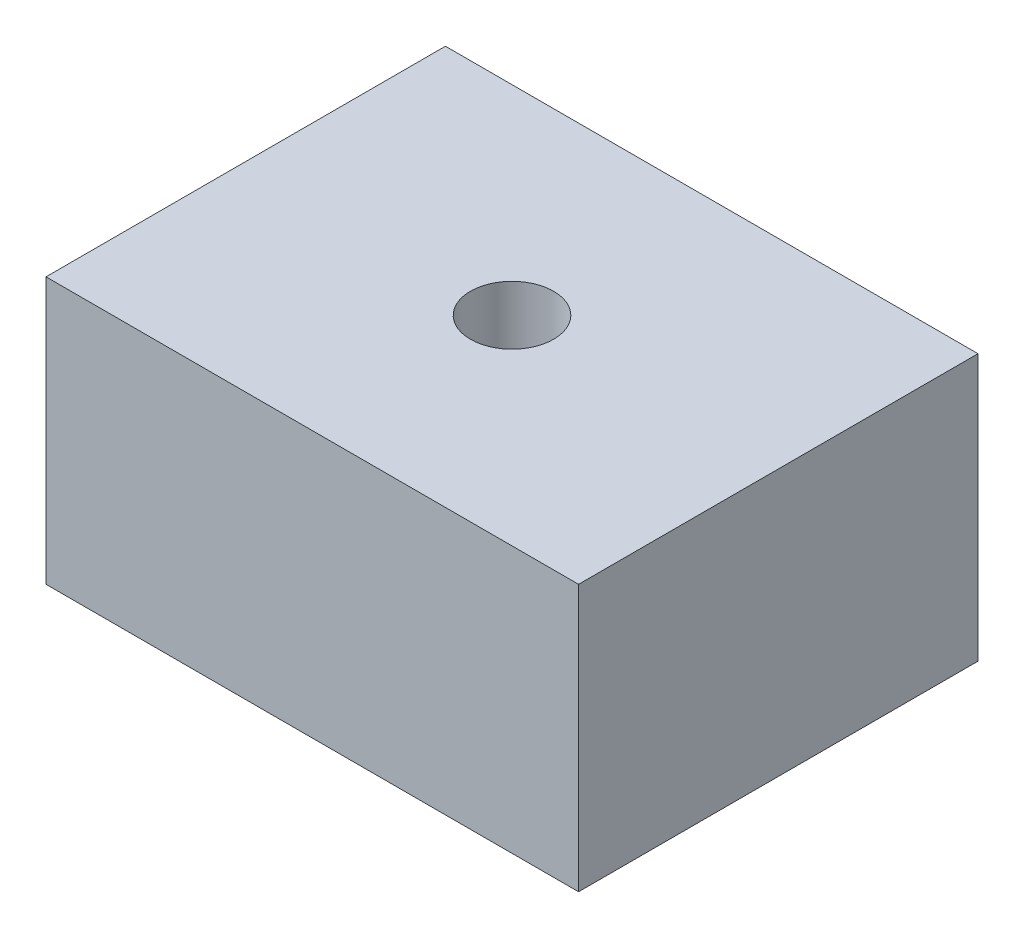
ISO-10303-21;
HEADER;
FILE_DESCRIPTION(('STEP AP214'),'2;1');
FILE_NAME('part.step','',(''),(''),'','','');
FILE_SCHEMA(('AUTOMOTIVE_DESIGN { 1 0 10303 214 1 1 1 1 }'));
ENDSEC;
DATA;
#1=APPLICATION_CONTEXT('core data for automotive mechanical design processes');
#2=APPLICATION_PROTOCOL_DEFINITION('international standard','automotive_design',2000,#1);
#3=PRODUCT_CONTEXT('',#1,'mechanical');
#4=PRODUCT('Part','Part','',(#3));
#5=PRODUCT_RELATED_PRODUCT_CATEGORY('part','',(#4));
#6=PRODUCT_DEFINITION_FORMATION('','',#4);
#7=PRODUCT_DEFINITION_CONTEXT('part definition',#1,'design');
#8=PRODUCT_DEFINITION('design','',#6,#7);
#9=PRODUCT_DEFINITION_SHAPE('','',#8);
#10=(LENGTH_UNIT() NAMED_UNIT(*) SI_UNIT(.MILLI.,.METRE.));
#11=(NAMED_UNIT(*) PLANE_ANGLE_UNIT() SI_UNIT($,.RADIAN.));
#12=(NAMED_UNIT(*) SI_UNIT($,.STERADIAN.) SOLID_ANGLE_UNIT());
#13=UNCERTAINTY_MEASURE_WITH_UNIT(LENGTH_MEASURE(1.E-05),#10,'distance_accuracy_value','');
#14=(GEOMETRIC_REPRESENTATION_CONTEXT(3) GLOBAL_UNCERTAINTY_ASSIGNED_CONTEXT((#13)) GLOBAL_UNIT_ASSIGNED_CONTEXT((#10,
#11,#12)) REPRESENTATION_CONTEXT('',''));
#15=CARTESIAN_POINT('',(0.,0.,0.));
#16=DIRECTION('',(0.,0.,1.));
#17=DIRECTION('',(1.,0.,0.));
#18=AXIS2_PLACEMENT_3D('',#15,#16,#17);
#19=CARTESIAN_POINT('',(0.,25.4,0.));
#20=DIRECTION('',(1.,0.,0.));
#21=DIRECTION('',(0.,0.,-1.));
#22=AXIS2_PLACEMENT_3D('',#19,#20,#21);
#23=PLANE('',#22);
#24=DIRECTION('',(0.,0.,1.));
#25=VECTOR('',#24,1.);
#26=CARTESIAN_POINT('',(0.,0.,0.));
#27=LINE('',#26,#25);
#28=CARTESIAN_POINT('',(0.,0.,0.));
#29=VERTEX_POINT('',#28);
#30=CARTESIAN_POINT('',(0.,0.,38.1));
#31=VERTEX_POINT('',#30);
#32=EDGE_CURVE('E117',#29,#31,#27,.T.);
#33=ORIENTED_EDGE('',*,*,#32,.T.);
#34=DIRECTION('',(0.,-1.,0.));
#35=VECTOR('',#34,1.);
#36=CARTESIAN_POINT('',(0.,25.4,38.1));
#37=LINE('',#36,#35);
#38=CARTESIAN_POINT('',(0.,25.4,38.1));
#39=VERTEX_POINT('',#38);
#40=EDGE_CURVE('E11',#39,#31,#37,.T.);
#41=ORIENTED_EDGE('',*,*,#40,.F.);
#42=DIRECTION('',(0.,0.,1.));
#43=VECTOR('',#42,1.);
#44=CARTESIAN_POINT('',(0.,25.4,0.));
#45=LINE('',#44,#43);
#46=CARTESIAN_POINT('',(0.,25.4,0.));
#47=VERTEX_POINT('',#46);
#48=EDGE_CURVE('E99',#47,#39,#45,.T.);
#49=ORIENTED_EDGE('',*,*,#48,.F.);
#50=DIRECTION('',(0.,-1.,0.));
#51=VECTOR('',#50,1.);
#52=CARTESIAN_POINT('',(0.,25.4,0.));
#53=LINE('',#52,#51);
#54=EDGE_CURVE('E113',#47,#29,#53,.T.);
#55=ORIENTED_EDGE('',*,*,#54,.T.);
#56=EDGE_LOOP('',(#33,#41,#49,#55));
#57=FACE_BOUND('',#56,.T.);
#58=ADVANCED_FACE('F47',(#57),#23,.F.);
#59=CARTESIAN_POINT('',(0.,25.4,38.1));
#60=DIRECTION('',(0.,0.,-1.));
#61=DIRECTION('',(-1.,0.,0.));
#62=AXIS2_PLACEMENT_3D('',#59,#60,#61);
#63=PLANE('',#62);
#64=DIRECTION('',(1.,0.,0.));
#65=VECTOR('',#64,1.);
#66=CARTESIAN_POINT('',(0.,0.,38.1));
#67=LINE('',#66,#65);
#68=CARTESIAN_POINT('',(50.8,0.,38.1));
#69=VERTEX_POINT('',#68);
#70=EDGE_CURVE('E104',#31,#69,#67,.T.);
#71=ORIENTED_EDGE('',*,*,#70,.T.);
#72=DIRECTION('',(0.,-1.,0.));
#73=VECTOR('',#72,1.);
#74=CARTESIAN_POINT('',(50.8,25.4,38.1));
#75=LINE('',#74,#73);
#76=CARTESIAN_POINT('',(50.8,25.4,38.1));
#77=VERTEX_POINT('',#76);
#78=EDGE_CURVE('E56',#77,#69,#75,.T.);
#79=ORIENTED_EDGE('',*,*,#78,.F.);
#80=DIRECTION('',(1.,0.,0.));
#81=VECTOR('',#80,1.);
#82=CARTESIAN_POINT('',(0.,25.4,38.1));
#83=LINE('',#82,#81);
#84=EDGE_CURVE('E94',#39,#77,#83,.T.);
#85=ORIENTED_EDGE('',*,*,#84,.F.);
#86=ORIENTED_EDGE('',*,*,#40,.T.);
#87=EDGE_LOOP('',(#71,#79,#85,#86));
#88=FACE_BOUND('',#87,.T.);
#89=ADVANCED_FACE('F103',(#88),#63,.F.);
#90=CARTESIAN_POINT('',(50.8,25.4,0.));
#91=DIRECTION('',(-1.,0.,0.));
#92=DIRECTION('',(0.,0.,1.));
#93=AXIS2_PLACEMENT_3D('',#90,#91,#92);
#94=PLANE('',#93);
#95=DIRECTION('',(0.,0.,-1.));
#96=VECTOR('',#95,1.);
#97=CARTESIAN_POINT('',(50.8,0.,0.));
#98=LINE('',#97,#96);
#99=CARTESIAN_POINT('',(50.8,0.,0.));
#100=VERTEX_POINT('',#99);
#101=EDGE_CURVE('E81',#69,#100,#98,.T.);
#102=ORIENTED_EDGE('',*,*,#101,.T.);
#103=DIRECTION('',(0.,-1.,0.));
#104=VECTOR('',#103,1.);
#105=CARTESIAN_POINT('',(50.8,25.4,0.));
#106=LINE('',#105,#104);
#107=CARTESIAN_POINT('',(50.8,25.4,0.));
#108=VERTEX_POINT('',#107);
#109=EDGE_CURVE('E106',#108,#100,#106,.T.);
#110=ORIENTED_EDGE('',*,*,#109,.F.);
#111=DIRECTION('',(0.,0.,-1.));
#112=VECTOR('',#111,1.);
#113=CARTESIAN_POINT('',(50.8,25.4,0.));
#114=LINE('',#113,#112);
#115=EDGE_CURVE('E97',#77,#108,#114,.T.);
#116=ORIENTED_EDGE('',*,*,#115,.F.);
#117=ORIENTED_EDGE('',*,*,#78,.T.);
#118=EDGE_LOOP('',(#102,#110,#116,#117));
#119=FACE_BOUND('',#118,.T.);
#120=ADVANCED_FACE('F107',(#119),#94,.F.);
#121=CARTESIAN_POINT('',(0.,25.4,0.));
#122=DIRECTION('',(0.,0.,1.));
#123=DIRECTION('',(1.,0.,0.));
#124=AXIS2_PLACEMENT_3D('',#121,#122,#123);
#125=PLANE('',#124);
#126=DIRECTION('',(-1.,0.,0.));
#127=VECTOR('',#126,1.);
#128=CARTESIAN_POINT('',(0.,0.,0.));
#129=LINE('',#128,#127);
#130=EDGE_CURVE('E87',#100,#29,#129,.T.);
#131=ORIENTED_EDGE('',*,*,#130,.T.);
#132=ORIENTED_EDGE('',*,*,#54,.F.);
#133=DIRECTION('',(-1.,0.,0.));
#134=VECTOR('',#133,1.);
#135=CARTESIAN_POINT('',(0.,25.4,0.));
#136=LINE('',#135,#134);
#137=EDGE_CURVE('E64',#108,#47,#136,.T.);
#138=ORIENTED_EDGE('',*,*,#137,.F.);
#139=ORIENTED_EDGE('',*,*,#109,.T.);
#140=EDGE_LOOP('',(#131,#132,#138,#139));
#141=FACE_BOUND('',#140,.T.);
#142=ADVANCED_FACE('F133',(#141),#125,.F.);
#143=CARTESIAN_POINT('',(0.,25.4,0.));
#144=DIRECTION('',(0.,1.,0.));
#145=DIRECTION('',(0.,0.,1.));
#146=AXIS2_PLACEMENT_3D('',#143,#144,#145);
#147=PLANE('',#146);
#148=CARTESIAN_POINT('',(25.4,25.4,19.05));
#149=DIRECTION('',(0.,1.,0.));
#150=DIRECTION('',(0.,0.,1.));
#151=AXIS2_PLACEMENT_3D('',#148,#149,#150);
#152=CIRCLE('',#151,3.96874999999999);
#153=CARTESIAN_POINT('',(25.4,25.4,23.01875));
#154=VERTEX_POINT('',#153);
#155=EDGE_CURVE('E145',#154,#154,#152,.T.);
#156=ORIENTED_EDGE('',*,*,#155,.F.);
#157=EDGE_LOOP('',(#156));
#158=FACE_BOUND('',#157,.T.);
#159=ORIENTED_EDGE('',*,*,#48,.T.);
#160=ORIENTED_EDGE('',*,*,#84,.T.);
#161=ORIENTED_EDGE('',*,*,#115,.T.);
#162=ORIENTED_EDGE('',*,*,#137,.T.);
#163=EDGE_LOOP('',(#159,#160,#161,#162));
#164=FACE_BOUND('',#163,.T.);
#165=ADVANCED_FACE('F95',(#158,#164),#147,.T.);
#166=CARTESIAN_POINT('',(0.,0.,0.));
#167=DIRECTION('',(0.,1.,0.));
#168=DIRECTION('',(0.,0.,1.));
#169=AXIS2_PLACEMENT_3D('',#166,#167,#168);
#170=PLANE('',#169);
#171=CARTESIAN_POINT('',(25.4,0.,19.05));
#172=DIRECTION('',(0.,1.,0.));
#173=DIRECTION('',(0.,0.,1.));
#174=AXIS2_PLACEMENT_3D('',#171,#172,#173);
#175=CIRCLE('',#174,3.96874999999999);
#176=CARTESIAN_POINT('',(25.4,0.,23.01875));
#177=VERTEX_POINT('',#176);
#178=EDGE_CURVE('E121',#177,#177,#175,.T.);
#179=ORIENTED_EDGE('',*,*,#178,.T.);
#180=EDGE_LOOP('',(#179));
#181=FACE_BOUND('',#180,.T.);
#182=ORIENTED_EDGE('',*,*,#32,.F.);
#183=ORIENTED_EDGE('',*,*,#130,.F.);
#184=ORIENTED_EDGE('',*,*,#101,.F.);
#185=ORIENTED_EDGE('',*,*,#70,.F.);
#186=EDGE_LOOP('',(#182,#183,#184,#185));
#187=FACE_BOUND('',#186,.T.);
#188=ADVANCED_FACE('F136',(#181,#187),#170,.F.);
#189=CARTESIAN_POINT('',(25.4,25.4,19.05));
#190=DIRECTION('',(0.,1.,0.));
#191=DIRECTION('',(0.,0.,1.));
#192=AXIS2_PLACEMENT_3D('',#189,#190,#191);
#193=CYLINDRICAL_SURFACE('',#192,3.96874999999999);
#194=ORIENTED_EDGE('',*,*,#178,.F.);
#195=EDGE_LOOP('',(#194));
#196=FACE_BOUND('',#195,.T.);
#197=ORIENTED_EDGE('',*,*,#155,.T.);
#198=EDGE_LOOP('',(#197));
#199=FACE_BOUND('',#198,.T.);
#200=ADVANCED_FACE('F152',(#196,#199),#193,.F.);
#201=CLOSED_SHELL('',(#58,#89,#120,#142,#165,#188,#200));
#202=MANIFOLD_SOLID_BREP('B2',#201);
#203=ADVANCED_BREP_SHAPE_REPRESENTATION('',(#18,#202),#14);
#204=SHAPE_DEFINITION_REPRESENTATION(#9,#203);
ENDSEC;
END-ISO-10303-21;
